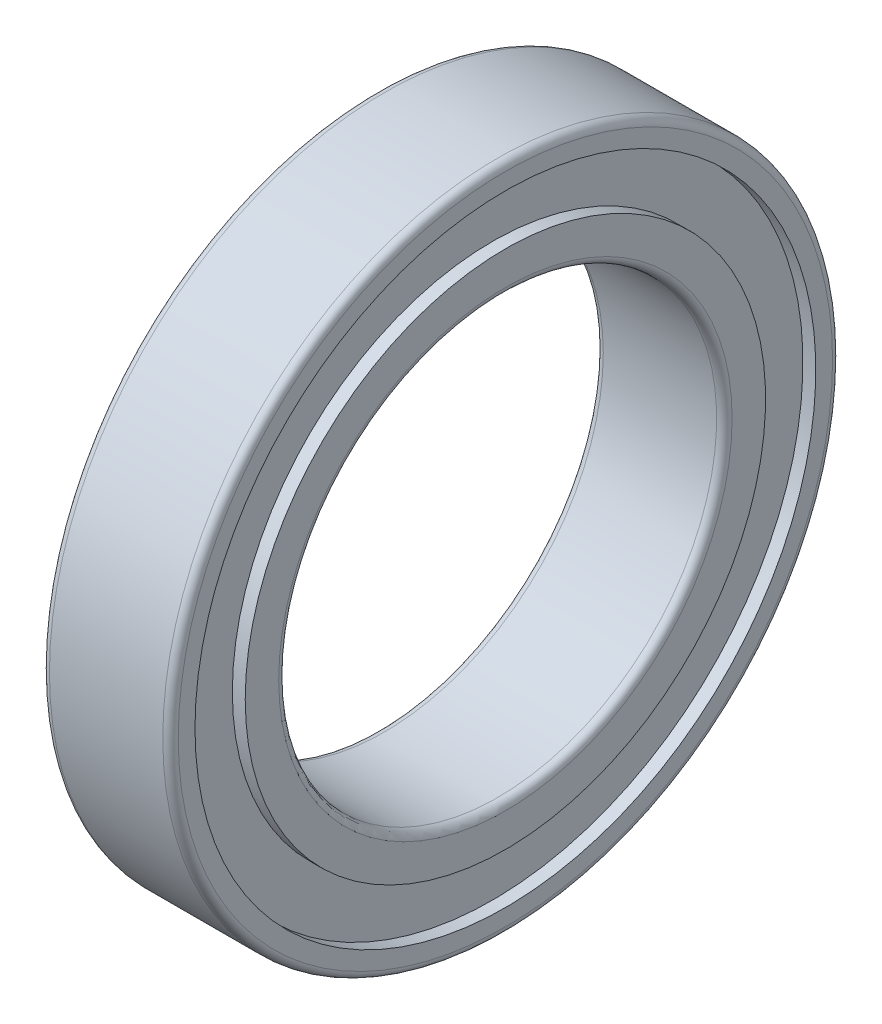
ISO-10303-21;
HEADER;
FILE_DESCRIPTION(('STEP AP214'),'2;1');
FILE_NAME('part.step','',(''),(''),'','','');
FILE_SCHEMA(('AUTOMOTIVE_DESIGN { 1 0 10303 214 1 1 1 1 }'));
ENDSEC;
DATA;
#1=APPLICATION_CONTEXT('core data for automotive mechanical design processes');
#2=APPLICATION_PROTOCOL_DEFINITION('international standard','automotive_design',2000,#1);
#3=PRODUCT_CONTEXT('',#1,'mechanical');
#4=PRODUCT('Part','Part','',(#3));
#5=PRODUCT_RELATED_PRODUCT_CATEGORY('part','',(#4));
#6=PRODUCT_DEFINITION_FORMATION('','',#4);
#7=PRODUCT_DEFINITION_CONTEXT('part definition',#1,'design');
#8=PRODUCT_DEFINITION('design','',#6,#7);
#9=PRODUCT_DEFINITION_SHAPE('','',#8);
#10=(LENGTH_UNIT() NAMED_UNIT(*) SI_UNIT(.MILLI.,.METRE.));
#11=(NAMED_UNIT(*) PLANE_ANGLE_UNIT() SI_UNIT($,.RADIAN.));
#12=(NAMED_UNIT(*) SI_UNIT($,.STERADIAN.) SOLID_ANGLE_UNIT());
#13=UNCERTAINTY_MEASURE_WITH_UNIT(LENGTH_MEASURE(1.E-05),#10,'distance_accuracy_value','');
#14=(GEOMETRIC_REPRESENTATION_CONTEXT(3) GLOBAL_UNCERTAINTY_ASSIGNED_CONTEXT((#13)) GLOBAL_UNIT_ASSIGNED_CONTEXT((#10,
#11,#12)) REPRESENTATION_CONTEXT('',''));
#15=CARTESIAN_POINT('',(0.,0.,0.));
#16=DIRECTION('',(0.,0.,1.));
#17=DIRECTION('',(1.,0.,0.));
#18=AXIS2_PLACEMENT_3D('',#15,#16,#17);
#19=CARTESIAN_POINT('',(0.,0.,0.));
#20=DIRECTION('',(-1.,0.,0.));
#21=DIRECTION('',(0.,0.,1.));
#22=AXIS2_PLACEMENT_3D('',#19,#20,#21);
#23=CYLINDRICAL_SURFACE('',#22,8.5);
#24=CARTESIAN_POINT('',(4.7,0.,0.));
#25=DIRECTION('',(-1.,0.,0.));
#26=DIRECTION('',(0.,0.,1.));
#27=AXIS2_PLACEMENT_3D('',#24,#25,#26);
#28=CIRCLE('',#27,8.5);
#29=CARTESIAN_POINT('',(4.7,0.,8.5));
#30=VERTEX_POINT('',#29);
#31=EDGE_CURVE('E269',#30,#30,#28,.T.);
#32=ORIENTED_EDGE('',*,*,#31,.F.);
#33=EDGE_LOOP('',(#32));
#34=FACE_BOUND('',#33,.T.);
#35=CARTESIAN_POINT('',(0.3,0.,0.));
#36=DIRECTION('',(1.,0.,0.));
#37=DIRECTION('',(0.,0.,-1.));
#38=AXIS2_PLACEMENT_3D('',#35,#36,#37);
#39=CIRCLE('',#38,8.5);
#40=CARTESIAN_POINT('',(0.3,0.,-8.5));
#41=VERTEX_POINT('',#40);
#42=EDGE_CURVE('E66',#41,#41,#39,.T.);
#43=ORIENTED_EDGE('',*,*,#42,.F.);
#44=EDGE_LOOP('',(#43));
#45=FACE_BOUND('',#44,.T.);
#46=ADVANCED_FACE('F17',(#34,#45),#23,.F.);
#47=CARTESIAN_POINT('',(4.7,0.,0.));
#48=DIRECTION('',(-1.,0.,0.));
#49=DIRECTION('',(0.,0.,1.));
#50=AXIS2_PLACEMENT_3D('',#47,#48,#49);
#51=TOROIDAL_SURFACE('',#50,8.8,0.3);
#52=CARTESIAN_POINT('',(5.,0.,0.));
#53=DIRECTION('',(1.,0.,0.));
#54=DIRECTION('',(0.,0.,1.));
#55=AXIS2_PLACEMENT_3D('',#52,#53,#54);
#56=CIRCLE('',#55,8.8);
#57=CARTESIAN_POINT('',(5.,0.,8.8));
#58=VERTEX_POINT('',#57);
#59=CARTESIAN_POINT('',(5.,0.,-8.8));
#60=VERTEX_POINT('',#59);
#61=EDGE_CURVE('E60',#58,#60,#56,.T.);
#62=ORIENTED_EDGE('',*,*,#61,.T.);
#63=CARTESIAN_POINT('',(5.,0.,0.));
#64=DIRECTION('',(1.,0.,0.));
#65=DIRECTION('',(0.,0.,-1.));
#66=AXIS2_PLACEMENT_3D('',#63,#64,#65);
#67=CIRCLE('',#66,8.8);
#68=EDGE_CURVE('E57',#60,#58,#67,.T.);
#69=ORIENTED_EDGE('',*,*,#68,.T.);
#70=EDGE_LOOP('',(#62,#69));
#71=FACE_BOUND('',#70,.T.);
#72=ORIENTED_EDGE('',*,*,#31,.T.);
#73=EDGE_LOOP('',(#72));
#74=FACE_BOUND('',#73,.T.);
#75=ADVANCED_FACE('F61',(#71,#74),#51,.T.);
#76=CARTESIAN_POINT('',(0.3,0.,0.));
#77=DIRECTION('',(1.,0.,0.));
#78=DIRECTION('',(0.,0.,-1.));
#79=AXIS2_PLACEMENT_3D('',#76,#77,#78);
#80=TOROIDAL_SURFACE('',#79,8.8,0.3);
#81=CARTESIAN_POINT('',(0.,0.,0.));
#82=DIRECTION('',(-1.,0.,0.));
#83=DIRECTION('',(0.,0.,-1.));
#84=AXIS2_PLACEMENT_3D('',#81,#82,#83);
#85=CIRCLE('',#84,8.8);
#86=CARTESIAN_POINT('',(0.,0.,-8.8));
#87=VERTEX_POINT('',#86);
#88=CARTESIAN_POINT('',(0.,0.,8.8));
#89=VERTEX_POINT('',#88);
#90=EDGE_CURVE('E70',#87,#89,#85,.T.);
#91=ORIENTED_EDGE('',*,*,#90,.T.);
#92=CARTESIAN_POINT('',(0.,0.,0.));
#93=DIRECTION('',(-1.,0.,0.));
#94=DIRECTION('',(0.,0.,1.));
#95=AXIS2_PLACEMENT_3D('',#92,#93,#94);
#96=CIRCLE('',#95,8.8);
#97=EDGE_CURVE('E224',#89,#87,#96,.T.);
#98=ORIENTED_EDGE('',*,*,#97,.T.);
#99=EDGE_LOOP('',(#91,#98));
#100=FACE_BOUND('',#99,.T.);
#101=ORIENTED_EDGE('',*,*,#42,.T.);
#102=EDGE_LOOP('',(#101));
#103=FACE_BOUND('',#102,.T.);
#104=ADVANCED_FACE('F91',(#100,#103),#80,.T.);
#105=CARTESIAN_POINT('',(5.,8.5,0.));
#106=DIRECTION('',(-1.,0.,0.));
#107=DIRECTION('',(0.,0.,1.));
#108=AXIS2_PLACEMENT_3D('',#105,#106,#107);
#109=PLANE('',#108);
#110=CARTESIAN_POINT('',(5.,0.,0.));
#111=DIRECTION('',(-1.,0.,0.));
#112=DIRECTION('',(0.,0.,1.));
#113=AXIS2_PLACEMENT_3D('',#110,#111,#112);
#114=CIRCLE('',#113,10.1);
#115=CARTESIAN_POINT('',(5.,0.,10.1));
#116=VERTEX_POINT('',#115);
#117=EDGE_CURVE('E232',#116,#116,#114,.T.);
#118=ORIENTED_EDGE('',*,*,#117,.F.);
#119=EDGE_LOOP('',(#118));
#120=FACE_BOUND('',#119,.T.);
#121=ORIENTED_EDGE('',*,*,#61,.F.);
#122=ORIENTED_EDGE('',*,*,#68,.F.);
#123=EDGE_LOOP('',(#121,#122));
#124=FACE_BOUND('',#123,.T.);
#125=ADVANCED_FACE('F69',(#120,#124),#109,.F.);
#126=CARTESIAN_POINT('',(0.,8.5,0.));
#127=DIRECTION('',(1.,0.,0.));
#128=DIRECTION('',(0.,0.,-1.));
#129=AXIS2_PLACEMENT_3D('',#126,#127,#128);
#130=PLANE('',#129);
#131=CARTESIAN_POINT('',(0.,0.,0.));
#132=DIRECTION('',(-1.,0.,0.));
#133=DIRECTION('',(0.,0.,1.));
#134=AXIS2_PLACEMENT_3D('',#131,#132,#133);
#135=CIRCLE('',#134,10.1);
#136=CARTESIAN_POINT('',(0.,0.,10.1));
#137=VERTEX_POINT('',#136);
#138=EDGE_CURVE('E235',#137,#137,#135,.F.);
#139=ORIENTED_EDGE('',*,*,#138,.F.);
#140=EDGE_LOOP('',(#139));
#141=FACE_BOUND('',#140,.T.);
#142=ORIENTED_EDGE('',*,*,#90,.F.);
#143=ORIENTED_EDGE('',*,*,#97,.F.);
#144=EDGE_LOOP('',(#142,#143));
#145=FACE_BOUND('',#144,.T.);
#146=ADVANCED_FACE('F90',(#141,#145),#130,.F.);
#147=CARTESIAN_POINT('',(0.,0.,0.));
#148=DIRECTION('',(-1.,0.,0.));
#149=DIRECTION('',(0.,0.,1.));
#150=AXIS2_PLACEMENT_3D('',#147,#148,#149);
#151=CYLINDRICAL_SURFACE('',#150,10.1);
#152=CARTESIAN_POINT('',(4.5,0.,0.));
#153=DIRECTION('',(-1.,0.,0.));
#154=DIRECTION('',(0.,0.,1.));
#155=AXIS2_PLACEMENT_3D('',#152,#153,#154);
#156=CIRCLE('',#155,10.1);
#157=CARTESIAN_POINT('',(4.5,0.,10.1));
#158=VERTEX_POINT('',#157);
#159=EDGE_CURVE('E265',#158,#158,#156,.F.);
#160=ORIENTED_EDGE('',*,*,#159,.T.);
#161=EDGE_LOOP('',(#160));
#162=FACE_BOUND('',#161,.T.);
#163=ORIENTED_EDGE('',*,*,#117,.T.);
#164=EDGE_LOOP('',(#163));
#165=FACE_BOUND('',#164,.T.);
#166=ADVANCED_FACE('F379',(#162,#165),#151,.T.);
#167=CARTESIAN_POINT('',(0.,0.,0.));
#168=DIRECTION('',(-1.,0.,0.));
#169=DIRECTION('',(0.,0.,1.));
#170=AXIS2_PLACEMENT_3D('',#167,#168,#169);
#171=CYLINDRICAL_SURFACE('',#170,10.1);
#172=ORIENTED_EDGE('',*,*,#138,.T.);
#173=EDGE_LOOP('',(#172));
#174=FACE_BOUND('',#173,.T.);
#175=CARTESIAN_POINT('',(0.5,0.,0.));
#176=DIRECTION('',(-1.,0.,0.));
#177=DIRECTION('',(0.,0.,1.));
#178=AXIS2_PLACEMENT_3D('',#175,#176,#177);
#179=CIRCLE('',#178,10.1);
#180=CARTESIAN_POINT('',(0.5,0.,10.1));
#181=VERTEX_POINT('',#180);
#182=EDGE_CURVE('E257',#181,#181,#179,.T.);
#183=ORIENTED_EDGE('',*,*,#182,.T.);
#184=EDGE_LOOP('',(#183));
#185=FACE_BOUND('',#184,.T.);
#186=ADVANCED_FACE('F369',(#174,#185),#171,.T.);
#187=CARTESIAN_POINT('',(4.5,12.05,0.));
#188=DIRECTION('',(-1.,0.,0.));
#189=DIRECTION('',(0.,0.,1.));
#190=AXIS2_PLACEMENT_3D('',#187,#188,#189);
#191=PLANE('',#190);
#192=ORIENTED_EDGE('',*,*,#159,.F.);
#193=EDGE_LOOP('',(#192));
#194=FACE_BOUND('',#193,.T.);
#195=CARTESIAN_POINT('',(4.5,0.,0.));
#196=DIRECTION('',(-1.,0.,0.));
#197=DIRECTION('',(0.,0.,1.));
#198=AXIS2_PLACEMENT_3D('',#195,#196,#197);
#199=CIRCLE('',#198,12.05);
#200=CARTESIAN_POINT('',(4.5,0.,12.05));
#201=VERTEX_POINT('',#200);
#202=EDGE_CURVE('E253',#201,#201,#199,.F.);
#203=ORIENTED_EDGE('',*,*,#202,.T.);
#204=EDGE_LOOP('',(#203));
#205=FACE_BOUND('',#204,.T.);
#206=ADVANCED_FACE('F359',(#194,#205),#191,.F.);
#207=CARTESIAN_POINT('',(0.5,10.1,0.));
#208=DIRECTION('',(1.,0.,0.));
#209=DIRECTION('',(0.,0.,-1.));
#210=AXIS2_PLACEMENT_3D('',#207,#208,#209);
#211=PLANE('',#210);
#212=CARTESIAN_POINT('',(0.5,0.,0.));
#213=DIRECTION('',(-1.,0.,0.));
#214=DIRECTION('',(0.,0.,1.));
#215=AXIS2_PLACEMENT_3D('',#212,#213,#214);
#216=CIRCLE('',#215,12.05);
#217=CARTESIAN_POINT('',(0.5,0.,12.05));
#218=VERTEX_POINT('',#217);
#219=EDGE_CURVE('E250',#218,#218,#216,.T.);
#220=ORIENTED_EDGE('',*,*,#219,.T.);
#221=EDGE_LOOP('',(#220));
#222=FACE_BOUND('',#221,.T.);
#223=ORIENTED_EDGE('',*,*,#182,.F.);
#224=EDGE_LOOP('',(#223));
#225=FACE_BOUND('',#224,.T.);
#226=ADVANCED_FACE('F350',(#222,#225),#211,.F.);
#227=CARTESIAN_POINT('',(0.,0.,0.));
#228=DIRECTION('',(-1.,0.,0.));
#229=DIRECTION('',(0.,0.,1.));
#230=AXIS2_PLACEMENT_3D('',#227,#228,#229);
#231=CYLINDRICAL_SURFACE('',#230,12.05);
#232=CARTESIAN_POINT('',(5.,0.,0.));
#233=DIRECTION('',(-1.,0.,0.));
#234=DIRECTION('',(0.,0.,1.));
#235=AXIS2_PLACEMENT_3D('',#232,#233,#234);
#236=CIRCLE('',#235,12.05);
#237=CARTESIAN_POINT('',(5.,0.,12.05));
#238=VERTEX_POINT('',#237);
#239=EDGE_CURVE('E247',#238,#238,#236,.F.);
#240=ORIENTED_EDGE('',*,*,#239,.T.);
#241=EDGE_LOOP('',(#240));
#242=FACE_BOUND('',#241,.T.);
#243=ORIENTED_EDGE('',*,*,#202,.F.);
#244=EDGE_LOOP('',(#243));
#245=FACE_BOUND('',#244,.T.);
#246=ADVANCED_FACE('F341',(#242,#245),#231,.F.);
#247=CARTESIAN_POINT('',(0.,0.,0.));
#248=DIRECTION('',(-1.,0.,0.));
#249=DIRECTION('',(0.,0.,1.));
#250=AXIS2_PLACEMENT_3D('',#247,#248,#249);
#251=CYLINDRICAL_SURFACE('',#250,12.05);
#252=ORIENTED_EDGE('',*,*,#219,.F.);
#253=EDGE_LOOP('',(#252));
#254=FACE_BOUND('',#253,.T.);
#255=CARTESIAN_POINT('',(0.,0.,0.));
#256=DIRECTION('',(-1.,0.,0.));
#257=DIRECTION('',(0.,0.,1.));
#258=AXIS2_PLACEMENT_3D('',#255,#256,#257);
#259=CIRCLE('',#258,12.05);
#260=CARTESIAN_POINT('',(0.,0.,12.05));
#261=VERTEX_POINT('',#260);
#262=EDGE_CURVE('E245',#261,#261,#259,.T.);
#263=ORIENTED_EDGE('',*,*,#262,.T.);
#264=EDGE_LOOP('',(#263));
#265=FACE_BOUND('',#264,.T.);
#266=ADVANCED_FACE('F192',(#254,#265),#251,.F.);
#267=CARTESIAN_POINT('',(5.,13.,0.));
#268=DIRECTION('',(-1.,0.,0.));
#269=DIRECTION('',(0.,0.,1.));
#270=AXIS2_PLACEMENT_3D('',#267,#268,#269);
#271=PLANE('',#270);
#272=ORIENTED_EDGE('',*,*,#239,.F.);
#273=EDGE_LOOP('',(#272));
#274=FACE_BOUND('',#273,.T.);
#275=CARTESIAN_POINT('',(5.,0.,0.));
#276=DIRECTION('',(-1.,0.,0.));
#277=DIRECTION('',(0.,0.,1.));
#278=AXIS2_PLACEMENT_3D('',#275,#276,#277);
#279=CIRCLE('',#278,12.7);
#280=CARTESIAN_POINT('',(5.,0.,12.7));
#281=VERTEX_POINT('',#280);
#282=CARTESIAN_POINT('',(5.,0.,-12.7));
#283=VERTEX_POINT('',#282);
#284=EDGE_CURVE('E178',#281,#283,#279,.T.);
#285=ORIENTED_EDGE('',*,*,#284,.F.);
#286=CARTESIAN_POINT('',(5.,0.,0.));
#287=DIRECTION('',(-1.,0.,0.));
#288=DIRECTION('',(0.,0.,-1.));
#289=AXIS2_PLACEMENT_3D('',#286,#287,#288);
#290=CIRCLE('',#289,12.7);
#291=EDGE_CURVE('E244',#283,#281,#290,.T.);
#292=ORIENTED_EDGE('',*,*,#291,.F.);
#293=EDGE_LOOP('',(#285,#292));
#294=FACE_BOUND('',#293,.T.);
#295=ADVANCED_FACE('F183',(#274,#294),#271,.F.);
#296=CARTESIAN_POINT('',(0.,12.05,0.));
#297=DIRECTION('',(1.,0.,0.));
#298=DIRECTION('',(0.,0.,-1.));
#299=AXIS2_PLACEMENT_3D('',#296,#297,#298);
#300=PLANE('',#299);
#301=ORIENTED_EDGE('',*,*,#262,.F.);
#302=EDGE_LOOP('',(#301));
#303=FACE_BOUND('',#302,.T.);
#304=CARTESIAN_POINT('',(0.,0.,0.));
#305=DIRECTION('',(1.,0.,0.));
#306=DIRECTION('',(0.,0.,-1.));
#307=AXIS2_PLACEMENT_3D('',#304,#305,#306);
#308=CIRCLE('',#307,12.7);
#309=CARTESIAN_POINT('',(0.,0.,-12.7));
#310=VERTEX_POINT('',#309);
#311=CARTESIAN_POINT('',(0.,0.,12.7));
#312=VERTEX_POINT('',#311);
#313=EDGE_CURVE('E148',#310,#312,#308,.T.);
#314=ORIENTED_EDGE('',*,*,#313,.F.);
#315=CARTESIAN_POINT('',(0.,0.,0.));
#316=DIRECTION('',(1.,0.,0.));
#317=DIRECTION('',(0.,0.,1.));
#318=AXIS2_PLACEMENT_3D('',#315,#316,#317);
#319=CIRCLE('',#318,12.7);
#320=EDGE_CURVE('E36',#312,#310,#319,.T.);
#321=ORIENTED_EDGE('',*,*,#320,.F.);
#322=EDGE_LOOP('',(#314,#321));
#323=FACE_BOUND('',#322,.T.);
#324=ADVANCED_FACE('F134',(#303,#323),#300,.F.);
#325=CARTESIAN_POINT('',(4.7,0.,0.));
#326=DIRECTION('',(-1.,0.,0.));
#327=DIRECTION('',(0.,0.,1.));
#328=AXIS2_PLACEMENT_3D('',#325,#326,#327);
#329=TOROIDAL_SURFACE('',#328,12.7,0.3);
#330=CARTESIAN_POINT('',(4.7,0.,0.));
#331=DIRECTION('',(-1.,0.,0.));
#332=DIRECTION('',(0.,0.,1.));
#333=AXIS2_PLACEMENT_3D('',#330,#331,#332);
#334=CIRCLE('',#333,13.);
#335=CARTESIAN_POINT('',(4.7,0.,13.));
#336=VERTEX_POINT('',#335);
#337=EDGE_CURVE('E28',#336,#336,#334,.T.);
#338=ORIENTED_EDGE('',*,*,#337,.F.);
#339=EDGE_LOOP('',(#338));
#340=FACE_BOUND('',#339,.T.);
#341=ORIENTED_EDGE('',*,*,#284,.T.);
#342=ORIENTED_EDGE('',*,*,#291,.T.);
#343=EDGE_LOOP('',(#341,#342));
#344=FACE_BOUND('',#343,.T.);
#345=ADVANCED_FACE('F122',(#340,#344),#329,.T.);
#346=CARTESIAN_POINT('',(0.3,0.,0.));
#347=DIRECTION('',(1.,0.,0.));
#348=DIRECTION('',(0.,0.,-1.));
#349=AXIS2_PLACEMENT_3D('',#346,#347,#348);
#350=TOROIDAL_SURFACE('',#349,12.7,0.3);
#351=CARTESIAN_POINT('',(0.3,0.,0.));
#352=DIRECTION('',(-1.,0.,0.));
#353=DIRECTION('',(0.,0.,1.));
#354=AXIS2_PLACEMENT_3D('',#351,#352,#353);
#355=CIRCLE('',#354,13.);
#356=CARTESIAN_POINT('',(0.3,0.,13.));
#357=VERTEX_POINT('',#356);
#358=EDGE_CURVE('E11',#357,#357,#355,.F.);
#359=ORIENTED_EDGE('',*,*,#358,.F.);
#360=EDGE_LOOP('',(#359));
#361=FACE_BOUND('',#360,.T.);
#362=ORIENTED_EDGE('',*,*,#313,.T.);
#363=ORIENTED_EDGE('',*,*,#320,.T.);
#364=EDGE_LOOP('',(#362,#363));
#365=FACE_BOUND('',#364,.T.);
#366=ADVANCED_FACE('F133',(#361,#365),#350,.T.);
#367=CARTESIAN_POINT('',(0.,0.,0.));
#368=DIRECTION('',(-1.,0.,0.));
#369=DIRECTION('',(0.,0.,1.));
#370=AXIS2_PLACEMENT_3D('',#367,#368,#369);
#371=CYLINDRICAL_SURFACE('',#370,13.);
#372=ORIENTED_EDGE('',*,*,#358,.T.);
#373=EDGE_LOOP('',(#372));
#374=FACE_BOUND('',#373,.T.);
#375=ORIENTED_EDGE('',*,*,#337,.T.);
#376=EDGE_LOOP('',(#375));
#377=FACE_BOUND('',#376,.T.);
#378=ADVANCED_FACE('F291',(#374,#377),#371,.T.);
#379=CLOSED_SHELL('',(#46,#75,#104,#125,#146,#166,#186,#206,#226,#246,#266,#295,#324,#345,#366,#378));
#380=MANIFOLD_SOLID_BREP('B1',#379);
#381=ADVANCED_BREP_SHAPE_REPRESENTATION('',(#18,#380),#14);
#382=SHAPE_DEFINITION_REPRESENTATION(#9,#381);
ENDSEC;
END-ISO-10303-21;
